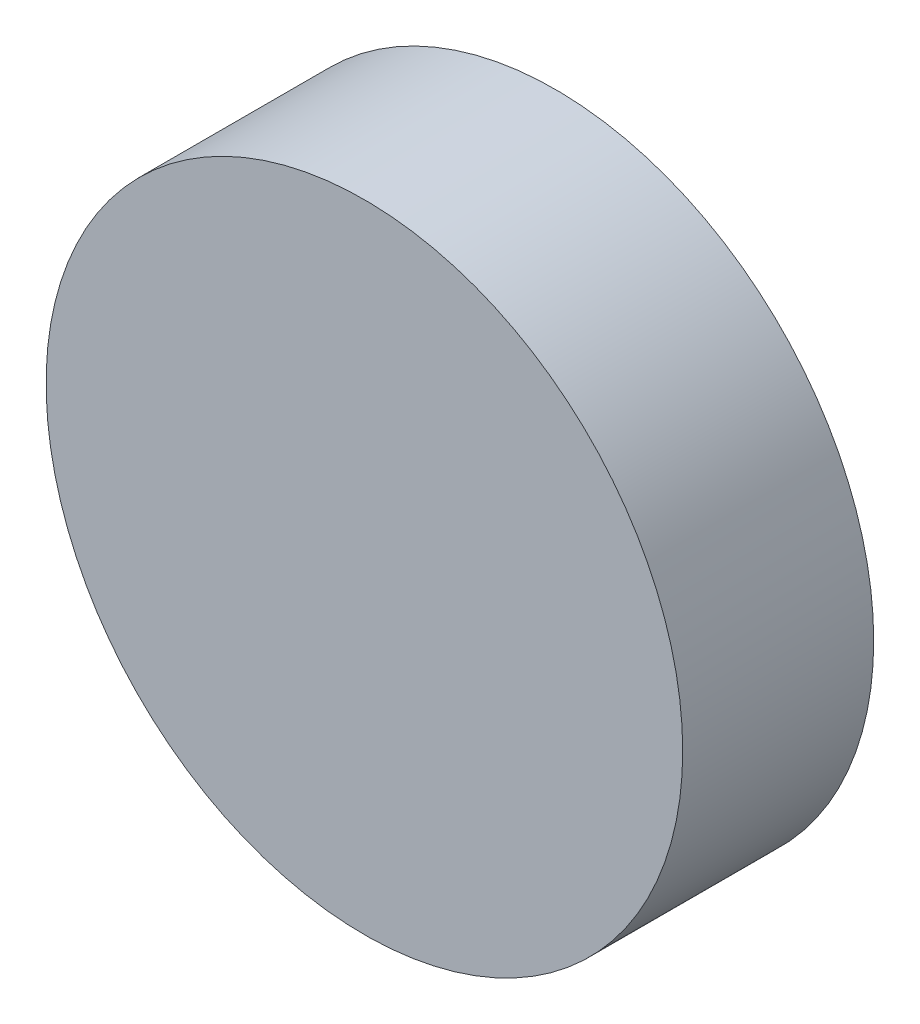
ISO-10303-21;
HEADER;
FILE_DESCRIPTION(('STEP AP214'),'2;1');
FILE_NAME('part.step','',(''),(''),'','','');
FILE_SCHEMA(('AUTOMOTIVE_DESIGN { 1 0 10303 214 1 1 1 1 }'));
ENDSEC;
DATA;
#1=APPLICATION_CONTEXT('core data for automotive mechanical design processes');
#2=APPLICATION_PROTOCOL_DEFINITION('international standard','automotive_design',2000,#1);
#3=PRODUCT_CONTEXT('',#1,'mechanical');
#4=PRODUCT('Part','Part','',(#3));
#5=PRODUCT_RELATED_PRODUCT_CATEGORY('part','',(#4));
#6=PRODUCT_DEFINITION_FORMATION('','',#4);
#7=PRODUCT_DEFINITION_CONTEXT('part definition',#1,'design');
#8=PRODUCT_DEFINITION('design','',#6,#7);
#9=PRODUCT_DEFINITION_SHAPE('','',#8);
#10=(LENGTH_UNIT() NAMED_UNIT(*) SI_UNIT(.MILLI.,.METRE.));
#11=(NAMED_UNIT(*) PLANE_ANGLE_UNIT() SI_UNIT($,.RADIAN.));
#12=(NAMED_UNIT(*) SI_UNIT($,.STERADIAN.) SOLID_ANGLE_UNIT());
#13=UNCERTAINTY_MEASURE_WITH_UNIT(LENGTH_MEASURE(1.E-05),#10,'distance_accuracy_value','');
#14=(GEOMETRIC_REPRESENTATION_CONTEXT(3) GLOBAL_UNCERTAINTY_ASSIGNED_CONTEXT((#13)) GLOBAL_UNIT_ASSIGNED_CONTEXT((#10,
#11,#12)) REPRESENTATION_CONTEXT('',''));
#15=CARTESIAN_POINT('',(0.,0.,0.));
#16=DIRECTION('',(0.,0.,1.));
#17=DIRECTION('',(1.,0.,0.));
#18=AXIS2_PLACEMENT_3D('',#15,#16,#17);
#19=CARTESIAN_POINT('',(0.,0.,1.5));
#20=DIRECTION('',(0.,0.,-1.));
#21=DIRECTION('',(-1.,0.,0.));
#22=AXIS2_PLACEMENT_3D('',#19,#20,#21);
#23=CYLINDRICAL_SURFACE('',#22,2.5);
#24=CARTESIAN_POINT('',(0.,0.,1.5));
#25=DIRECTION('',(0.,0.,1.));
#26=DIRECTION('',(1.,0.,0.));
#27=AXIS2_PLACEMENT_3D('',#24,#25,#26);
#28=CIRCLE('',#27,2.5);
#29=CARTESIAN_POINT('',(2.5,0.,1.5));
#30=VERTEX_POINT('',#29);
#31=EDGE_CURVE('E10',#30,#30,#28,.T.);
#32=ORIENTED_EDGE('',*,*,#31,.F.);
#33=EDGE_LOOP('',(#32));
#34=FACE_BOUND('',#33,.T.);
#35=CARTESIAN_POINT('',(0.,0.,0.));
#36=DIRECTION('',(0.,0.,1.));
#37=DIRECTION('',(1.,0.,0.));
#38=AXIS2_PLACEMENT_3D('',#35,#36,#37);
#39=CIRCLE('',#38,2.5);
#40=CARTESIAN_POINT('',(2.5,0.,0.));
#41=VERTEX_POINT('',#40);
#42=EDGE_CURVE('E33',#41,#41,#39,.T.);
#43=ORIENTED_EDGE('',*,*,#42,.T.);
#44=EDGE_LOOP('',(#43));
#45=FACE_BOUND('',#44,.T.);
#46=ADVANCED_FACE('F30',(#34,#45),#23,.T.);
#47=CARTESIAN_POINT('',(0.,0.,1.5));
#48=DIRECTION('',(0.,0.,1.));
#49=DIRECTION('',(1.,0.,0.));
#50=AXIS2_PLACEMENT_3D('',#47,#48,#49);
#51=PLANE('',#50);
#52=ORIENTED_EDGE('',*,*,#31,.T.);
#53=EDGE_LOOP('',(#52));
#54=FACE_BOUND('',#53,.T.);
#55=ADVANCED_FACE('F45',(#54),#51,.T.);
#56=CARTESIAN_POINT('',(0.,0.,0.));
#57=DIRECTION('',(0.,0.,1.));
#58=DIRECTION('',(1.,0.,0.));
#59=AXIS2_PLACEMENT_3D('',#56,#57,#58);
#60=PLANE('',#59);
#61=ORIENTED_EDGE('',*,*,#42,.F.);
#62=EDGE_LOOP('',(#61));
#63=FACE_BOUND('',#62,.T.);
#64=ADVANCED_FACE('F43',(#63),#60,.F.);
#65=CLOSED_SHELL('',(#46,#55,#64));
#66=MANIFOLD_SOLID_BREP('B2',#65);
#67=ADVANCED_BREP_SHAPE_REPRESENTATION('',(#18,#66),#14);
#68=SHAPE_DEFINITION_REPRESENTATION(#9,#67);
ENDSEC;
END-ISO-10303-21;
